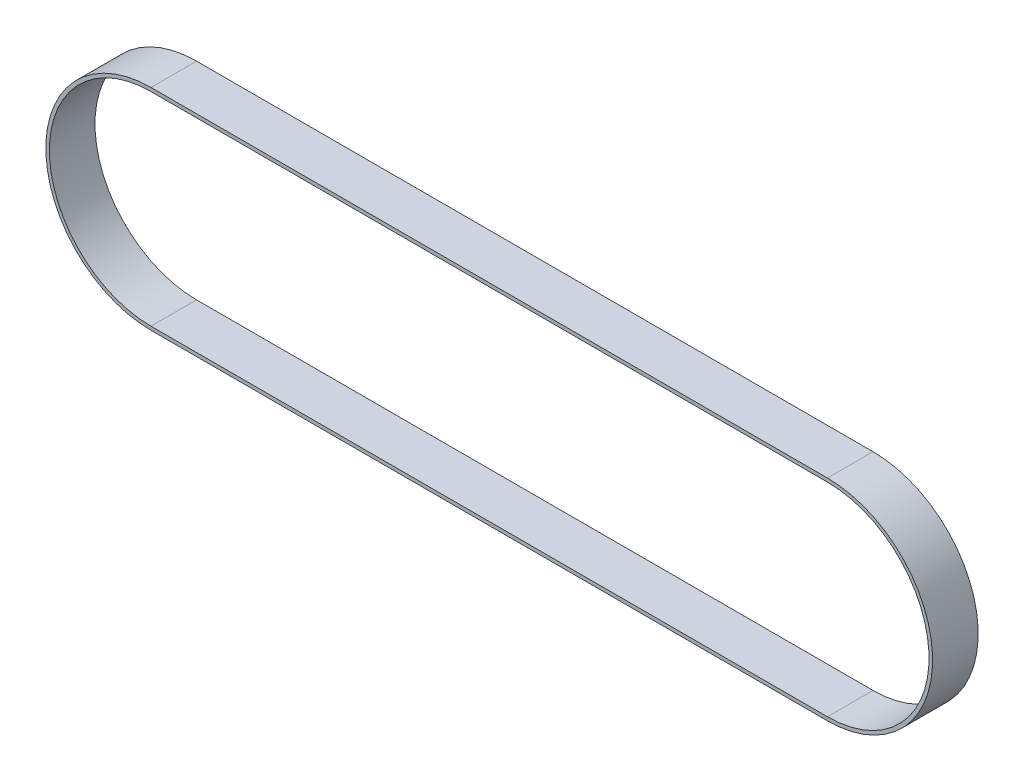
ISO-10303-21;
HEADER;
FILE_DESCRIPTION(('STEP AP214'),'2;1');
FILE_NAME('part.step','',(''),(''),'','','');
FILE_SCHEMA(('AUTOMOTIVE_DESIGN { 1 0 10303 214 1 1 1 1 }'));
ENDSEC;
DATA;
#1=APPLICATION_CONTEXT('core data for automotive mechanical design processes');
#2=APPLICATION_PROTOCOL_DEFINITION('international standard','automotive_design',2000,#1);
#3=PRODUCT_CONTEXT('',#1,'mechanical');
#4=PRODUCT('Part','Part','',(#3));
#5=PRODUCT_RELATED_PRODUCT_CATEGORY('part','',(#4));
#6=PRODUCT_DEFINITION_FORMATION('','',#4);
#7=PRODUCT_DEFINITION_CONTEXT('part definition',#1,'design');
#8=PRODUCT_DEFINITION('design','',#6,#7);
#9=PRODUCT_DEFINITION_SHAPE('','',#8);
#10=(LENGTH_UNIT() NAMED_UNIT(*) SI_UNIT(.MILLI.,.METRE.));
#11=(NAMED_UNIT(*) PLANE_ANGLE_UNIT() SI_UNIT($,.RADIAN.));
#12=(NAMED_UNIT(*) SI_UNIT($,.STERADIAN.) SOLID_ANGLE_UNIT());
#13=UNCERTAINTY_MEASURE_WITH_UNIT(LENGTH_MEASURE(1.E-05),#10,'distance_accuracy_value','');
#14=(GEOMETRIC_REPRESENTATION_CONTEXT(3) GLOBAL_UNCERTAINTY_ASSIGNED_CONTEXT((#13)) GLOBAL_UNIT_ASSIGNED_CONTEXT((#10,
#11,#12)) REPRESENTATION_CONTEXT('',''));
#15=CARTESIAN_POINT('',(0.,0.,0.));
#16=DIRECTION('',(0.,0.,1.));
#17=DIRECTION('',(1.,0.,0.));
#18=AXIS2_PLACEMENT_3D('',#15,#16,#17);
#19=CARTESIAN_POINT('',(0.,0.,15.));
#20=DIRECTION('',(0.,0.,1.));
#21=DIRECTION('',(1.,0.,0.));
#22=AXIS2_PLACEMENT_3D('',#19,#20,#21);
#23=PLANE('',#22);
#24=CARTESIAN_POINT('',(0.,0.,15.));
#25=DIRECTION('',(0.,0.,1.));
#26=DIRECTION('',(1.,0.,0.));
#27=AXIS2_PLACEMENT_3D('',#24,#25,#26);
#28=CIRCLE('',#27,34.5948);
#29=CARTESIAN_POINT('',(0.,34.5948,15.));
#30=VERTEX_POINT('',#29);
#31=CARTESIAN_POINT('',(0.,-34.5948,15.));
#32=VERTEX_POINT('',#31);
#33=EDGE_CURVE('E135',#30,#32,#28,.T.);
#34=ORIENTED_EDGE('',*,*,#33,.T.);
#35=DIRECTION('',(1.,0.,0.));
#36=VECTOR('',#35,1.);
#37=CARTESIAN_POINT('',(0.,-34.5948,15.));
#38=LINE('',#37,#36);
#39=CARTESIAN_POINT('',(222.5548,-34.5948,15.));
#40=VERTEX_POINT('',#39);
#41=EDGE_CURVE('E138',#32,#40,#38,.T.);
#42=ORIENTED_EDGE('',*,*,#41,.T.);
#43=CARTESIAN_POINT('',(222.5548,0.,15.));
#44=DIRECTION('',(0.,0.,1.));
#45=DIRECTION('',(1.,0.,0.));
#46=AXIS2_PLACEMENT_3D('',#43,#44,#45);
#47=CIRCLE('',#46,34.5948);
#48=CARTESIAN_POINT('',(222.5548,34.5948,15.));
#49=VERTEX_POINT('',#48);
#50=EDGE_CURVE('E141',#40,#49,#47,.T.);
#51=ORIENTED_EDGE('',*,*,#50,.T.);
#52=DIRECTION('',(-1.,0.,0.));
#53=VECTOR('',#52,1.);
#54=CARTESIAN_POINT('',(0.,34.5948,15.));
#55=LINE('',#54,#53);
#56=EDGE_CURVE('E143',#49,#30,#55,.T.);
#57=ORIENTED_EDGE('',*,*,#56,.T.);
#58=EDGE_LOOP('',(#34,#42,#51,#57));
#59=FACE_BOUND('',#58,.T.);
#60=DIRECTION('',(1.,0.,0.));
#61=VECTOR('',#60,1.);
#62=CARTESIAN_POINT('',(0.,-33.4264,15.));
#63=LINE('',#62,#61);
#64=CARTESIAN_POINT('',(0.,-33.4264,15.));
#65=VERTEX_POINT('',#64);
#66=CARTESIAN_POINT('',(222.5548,-33.4264,15.));
#67=VERTEX_POINT('',#66);
#68=EDGE_CURVE('E107',#65,#67,#63,.T.);
#69=ORIENTED_EDGE('',*,*,#68,.F.);
#70=CARTESIAN_POINT('',(0.,0.,15.));
#71=DIRECTION('',(0.,0.,1.));
#72=DIRECTION('',(1.,0.,0.));
#73=AXIS2_PLACEMENT_3D('',#70,#71,#72);
#74=CIRCLE('',#73,33.4264);
#75=CARTESIAN_POINT('',(0.,33.4264,15.));
#76=VERTEX_POINT('',#75);
#77=EDGE_CURVE('E99',#76,#65,#74,.T.);
#78=ORIENTED_EDGE('',*,*,#77,.F.);
#79=DIRECTION('',(-1.,0.,0.));
#80=VECTOR('',#79,1.);
#81=CARTESIAN_POINT('',(0.,33.4264,15.));
#82=LINE('',#81,#80);
#83=CARTESIAN_POINT('',(222.5548,33.4264,15.));
#84=VERTEX_POINT('',#83);
#85=EDGE_CURVE('E121',#84,#76,#82,.T.);
#86=ORIENTED_EDGE('',*,*,#85,.F.);
#87=CARTESIAN_POINT('',(222.5548,0.,15.));
#88=DIRECTION('',(0.,0.,1.));
#89=DIRECTION('',(1.,0.,0.));
#90=AXIS2_PLACEMENT_3D('',#87,#88,#89);
#91=CIRCLE('',#90,33.4264);
#92=EDGE_CURVE('E119',#67,#84,#91,.T.);
#93=ORIENTED_EDGE('',*,*,#92,.F.);
#94=EDGE_LOOP('',(#69,#78,#86,#93));
#95=FACE_BOUND('',#94,.T.);
#96=ADVANCED_FACE('F34',(#59,#95),#23,.T.);
#97=CARTESIAN_POINT('',(0.,0.,0.));
#98=DIRECTION('',(0.,0.,1.));
#99=DIRECTION('',(1.,0.,0.));
#100=AXIS2_PLACEMENT_3D('',#97,#98,#99);
#101=PLANE('',#100);
#102=CARTESIAN_POINT('',(0.,0.,0.));
#103=DIRECTION('',(0.,0.,1.));
#104=DIRECTION('',(1.,0.,0.));
#105=AXIS2_PLACEMENT_3D('',#102,#103,#104);
#106=CIRCLE('',#105,34.5948);
#107=CARTESIAN_POINT('',(0.,34.5948,0.));
#108=VERTEX_POINT('',#107);
#109=CARTESIAN_POINT('',(0.,-34.5948,0.));
#110=VERTEX_POINT('',#109);
#111=EDGE_CURVE('E115',#108,#110,#106,.T.);
#112=ORIENTED_EDGE('',*,*,#111,.F.);
#113=DIRECTION('',(-1.,0.,0.));
#114=VECTOR('',#113,1.);
#115=CARTESIAN_POINT('',(0.,34.5948,0.));
#116=LINE('',#115,#114);
#117=CARTESIAN_POINT('',(222.5548,34.5948,0.));
#118=VERTEX_POINT('',#117);
#119=EDGE_CURVE('E139',#118,#108,#116,.T.);
#120=ORIENTED_EDGE('',*,*,#119,.F.);
#121=CARTESIAN_POINT('',(222.5548,0.,0.));
#122=DIRECTION('',(0.,0.,1.));
#123=DIRECTION('',(1.,0.,0.));
#124=AXIS2_PLACEMENT_3D('',#121,#122,#123);
#125=CIRCLE('',#124,34.5948);
#126=CARTESIAN_POINT('',(222.5548,-34.5948,0.));
#127=VERTEX_POINT('',#126);
#128=EDGE_CURVE('E150',#127,#118,#125,.T.);
#129=ORIENTED_EDGE('',*,*,#128,.F.);
#130=DIRECTION('',(1.,0.,0.));
#131=VECTOR('',#130,1.);
#132=CARTESIAN_POINT('',(0.,-34.5948,0.));
#133=LINE('',#132,#131);
#134=EDGE_CURVE('E148',#110,#127,#133,.T.);
#135=ORIENTED_EDGE('',*,*,#134,.F.);
#136=EDGE_LOOP('',(#112,#120,#129,#135));
#137=FACE_BOUND('',#136,.T.);
#138=CARTESIAN_POINT('',(0.,0.,0.));
#139=DIRECTION('',(0.,0.,1.));
#140=DIRECTION('',(1.,0.,0.));
#141=AXIS2_PLACEMENT_3D('',#138,#139,#140);
#142=CIRCLE('',#141,33.4264);
#143=CARTESIAN_POINT('',(0.,33.4264,0.));
#144=VERTEX_POINT('',#143);
#145=CARTESIAN_POINT('',(0.,-33.4264,0.));
#146=VERTEX_POINT('',#145);
#147=EDGE_CURVE('E57',#144,#146,#142,.T.);
#148=ORIENTED_EDGE('',*,*,#147,.T.);
#149=DIRECTION('',(1.,0.,0.));
#150=VECTOR('',#149,1.);
#151=CARTESIAN_POINT('',(0.,-33.4264,0.));
#152=LINE('',#151,#150);
#153=CARTESIAN_POINT('',(222.5548,-33.4264,0.));
#154=VERTEX_POINT('',#153);
#155=EDGE_CURVE('E114',#146,#154,#152,.T.);
#156=ORIENTED_EDGE('',*,*,#155,.T.);
#157=CARTESIAN_POINT('',(222.5548,0.,0.));
#158=DIRECTION('',(0.,0.,1.));
#159=DIRECTION('',(1.,0.,0.));
#160=AXIS2_PLACEMENT_3D('',#157,#158,#159);
#161=CIRCLE('',#160,33.4264);
#162=CARTESIAN_POINT('',(222.5548,33.4264,0.));
#163=VERTEX_POINT('',#162);
#164=EDGE_CURVE('E127',#154,#163,#161,.T.);
#165=ORIENTED_EDGE('',*,*,#164,.T.);
#166=DIRECTION('',(-1.,0.,0.));
#167=VECTOR('',#166,1.);
#168=CARTESIAN_POINT('',(0.,33.4264,0.));
#169=LINE('',#168,#167);
#170=EDGE_CURVE('E108',#163,#144,#169,.T.);
#171=ORIENTED_EDGE('',*,*,#170,.T.);
#172=EDGE_LOOP('',(#148,#156,#165,#171));
#173=FACE_BOUND('',#172,.T.);
#174=ADVANCED_FACE('F168',(#137,#173),#101,.F.);
#175=CARTESIAN_POINT('',(0.,0.,15.));
#176=DIRECTION('',(0.,0.,-1.));
#177=DIRECTION('',(-1.,0.,0.));
#178=AXIS2_PLACEMENT_3D('',#175,#176,#177);
#179=CYLINDRICAL_SURFACE('',#178,34.5948);
#180=ORIENTED_EDGE('',*,*,#111,.T.);
#181=DIRECTION('',(0.,0.,-1.));
#182=VECTOR('',#181,1.);
#183=CARTESIAN_POINT('',(0.,-34.5948,15.));
#184=LINE('',#183,#182);
#185=EDGE_CURVE('E11',#32,#110,#184,.T.);
#186=ORIENTED_EDGE('',*,*,#185,.F.);
#187=ORIENTED_EDGE('',*,*,#33,.F.);
#188=DIRECTION('',(0.,0.,-1.));
#189=VECTOR('',#188,1.);
#190=CARTESIAN_POINT('',(0.,34.5948,15.));
#191=LINE('',#190,#189);
#192=EDGE_CURVE('E145',#30,#108,#191,.T.);
#193=ORIENTED_EDGE('',*,*,#192,.T.);
#194=EDGE_LOOP('',(#180,#186,#187,#193));
#195=FACE_BOUND('',#194,.T.);
#196=ADVANCED_FACE('F36',(#195),#179,.T.);
#197=CARTESIAN_POINT('',(0.,-34.5948,15.));
#198=DIRECTION('',(0.,1.,0.));
#199=DIRECTION('',(0.,0.,1.));
#200=AXIS2_PLACEMENT_3D('',#197,#198,#199);
#201=PLANE('',#200);
#202=ORIENTED_EDGE('',*,*,#134,.T.);
#203=DIRECTION('',(0.,0.,-1.));
#204=VECTOR('',#203,1.);
#205=CARTESIAN_POINT('',(222.5548,-34.5948,15.));
#206=LINE('',#205,#204);
#207=EDGE_CURVE('E42',#40,#127,#206,.T.);
#208=ORIENTED_EDGE('',*,*,#207,.F.);
#209=ORIENTED_EDGE('',*,*,#41,.F.);
#210=ORIENTED_EDGE('',*,*,#185,.T.);
#211=EDGE_LOOP('',(#202,#208,#209,#210));
#212=FACE_BOUND('',#211,.T.);
#213=ADVANCED_FACE('F178',(#212),#201,.F.);
#214=CARTESIAN_POINT('',(222.5548,0.,15.));
#215=DIRECTION('',(0.,0.,-1.));
#216=DIRECTION('',(-1.,0.,0.));
#217=AXIS2_PLACEMENT_3D('',#214,#215,#216);
#218=CYLINDRICAL_SURFACE('',#217,34.5948);
#219=ORIENTED_EDGE('',*,*,#128,.T.);
#220=DIRECTION('',(0.,0.,-1.));
#221=VECTOR('',#220,1.);
#222=CARTESIAN_POINT('',(222.5548,34.5948,15.));
#223=LINE('',#222,#221);
#224=EDGE_CURVE('E155',#49,#118,#223,.T.);
#225=ORIENTED_EDGE('',*,*,#224,.F.);
#226=ORIENTED_EDGE('',*,*,#50,.F.);
#227=ORIENTED_EDGE('',*,*,#207,.T.);
#228=EDGE_LOOP('',(#219,#225,#226,#227));
#229=FACE_BOUND('',#228,.T.);
#230=ADVANCED_FACE('F162',(#229),#218,.T.);
#231=CARTESIAN_POINT('',(0.,34.5948,15.));
#232=DIRECTION('',(0.,-1.,0.));
#233=DIRECTION('',(0.,0.,-1.));
#234=AXIS2_PLACEMENT_3D('',#231,#232,#233);
#235=PLANE('',#234);
#236=ORIENTED_EDGE('',*,*,#119,.T.);
#237=ORIENTED_EDGE('',*,*,#192,.F.);
#238=ORIENTED_EDGE('',*,*,#56,.F.);
#239=ORIENTED_EDGE('',*,*,#224,.T.);
#240=EDGE_LOOP('',(#236,#237,#238,#239));
#241=FACE_BOUND('',#240,.T.);
#242=ADVANCED_FACE('F172',(#241),#235,.F.);
#243=CARTESIAN_POINT('',(0.,0.,15.));
#244=DIRECTION('',(0.,0.,-1.));
#245=DIRECTION('',(-1.,0.,0.));
#246=AXIS2_PLACEMENT_3D('',#243,#244,#245);
#247=CYLINDRICAL_SURFACE('',#246,33.4264);
#248=ORIENTED_EDGE('',*,*,#147,.F.);
#249=DIRECTION('',(0.,0.,-1.));
#250=VECTOR('',#249,1.);
#251=CARTESIAN_POINT('',(0.,33.4264,15.));
#252=LINE('',#251,#250);
#253=EDGE_CURVE('E103',#76,#144,#252,.T.);
#254=ORIENTED_EDGE('',*,*,#253,.F.);
#255=ORIENTED_EDGE('',*,*,#77,.T.);
#256=DIRECTION('',(0.,0.,-1.));
#257=VECTOR('',#256,1.);
#258=CARTESIAN_POINT('',(0.,-33.4264,15.));
#259=LINE('',#258,#257);
#260=EDGE_CURVE('E102',#65,#146,#259,.T.);
#261=ORIENTED_EDGE('',*,*,#260,.T.);
#262=EDGE_LOOP('',(#248,#254,#255,#261));
#263=FACE_BOUND('',#262,.T.);
#264=ADVANCED_FACE('F101',(#263),#247,.F.);
#265=CARTESIAN_POINT('',(0.,-33.4264,15.));
#266=DIRECTION('',(0.,1.,0.));
#267=DIRECTION('',(0.,0.,1.));
#268=AXIS2_PLACEMENT_3D('',#265,#266,#267);
#269=PLANE('',#268);
#270=ORIENTED_EDGE('',*,*,#155,.F.);
#271=ORIENTED_EDGE('',*,*,#260,.F.);
#272=ORIENTED_EDGE('',*,*,#68,.T.);
#273=DIRECTION('',(0.,0.,-1.));
#274=VECTOR('',#273,1.);
#275=CARTESIAN_POINT('',(222.5548,-33.4264,15.));
#276=LINE('',#275,#274);
#277=EDGE_CURVE('E116',#67,#154,#276,.T.);
#278=ORIENTED_EDGE('',*,*,#277,.T.);
#279=EDGE_LOOP('',(#270,#271,#272,#278));
#280=FACE_BOUND('',#279,.T.);
#281=ADVANCED_FACE('F111',(#280),#269,.T.);
#282=CARTESIAN_POINT('',(222.5548,0.,15.));
#283=DIRECTION('',(0.,0.,-1.));
#284=DIRECTION('',(-1.,0.,0.));
#285=AXIS2_PLACEMENT_3D('',#282,#283,#284);
#286=CYLINDRICAL_SURFACE('',#285,33.4264);
#287=ORIENTED_EDGE('',*,*,#164,.F.);
#288=ORIENTED_EDGE('',*,*,#277,.F.);
#289=ORIENTED_EDGE('',*,*,#92,.T.);
#290=DIRECTION('',(0.,0.,-1.));
#291=VECTOR('',#290,1.);
#292=CARTESIAN_POINT('',(222.5548,33.4264,15.));
#293=LINE('',#292,#291);
#294=EDGE_CURVE('E49',#84,#163,#293,.T.);
#295=ORIENTED_EDGE('',*,*,#294,.T.);
#296=EDGE_LOOP('',(#287,#288,#289,#295));
#297=FACE_BOUND('',#296,.T.);
#298=ADVANCED_FACE('F201',(#297),#286,.F.);
#299=CARTESIAN_POINT('',(0.,33.4264,15.));
#300=DIRECTION('',(0.,-1.,0.));
#301=DIRECTION('',(0.,0.,-1.));
#302=AXIS2_PLACEMENT_3D('',#299,#300,#301);
#303=PLANE('',#302);
#304=ORIENTED_EDGE('',*,*,#170,.F.);
#305=ORIENTED_EDGE('',*,*,#294,.F.);
#306=ORIENTED_EDGE('',*,*,#85,.T.);
#307=ORIENTED_EDGE('',*,*,#253,.T.);
#308=EDGE_LOOP('',(#304,#305,#306,#307));
#309=FACE_BOUND('',#308,.T.);
#310=ADVANCED_FACE('F205',(#309),#303,.T.);
#311=CLOSED_SHELL('',(#96,#174,#196,#213,#230,#242,#264,#281,#298,#310));
#312=MANIFOLD_SOLID_BREP('B2',#311);
#313=ADVANCED_BREP_SHAPE_REPRESENTATION('',(#18,#312),#14);
#314=SHAPE_DEFINITION_REPRESENTATION(#9,#313);
ENDSEC;
END-ISO-10303-21;
